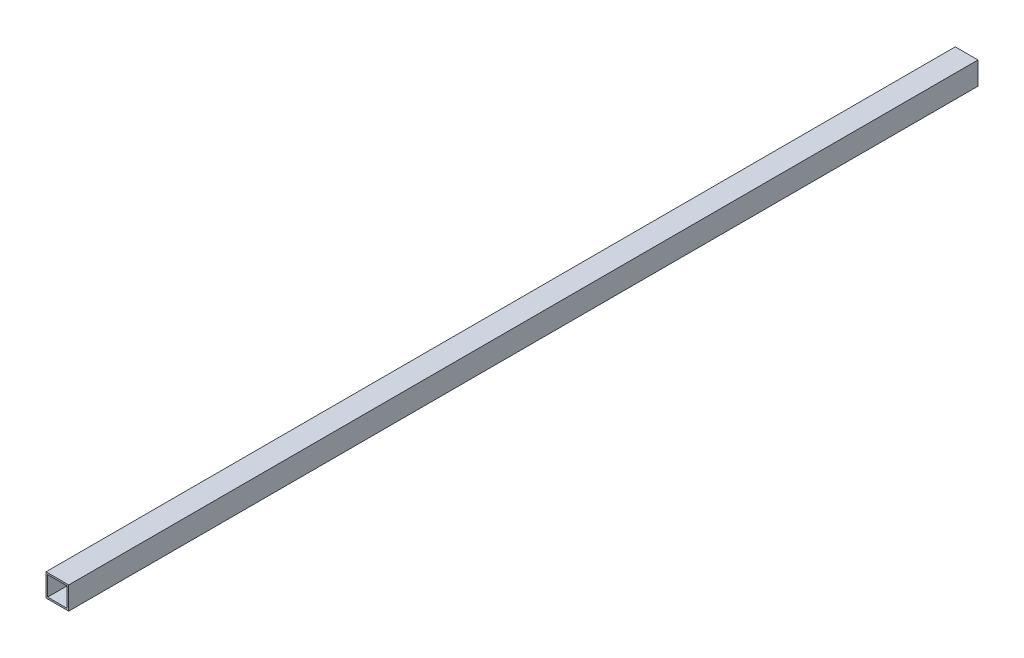
ISO-10303-21;
HEADER;
FILE_DESCRIPTION(('STEP AP214'),'2;1');
FILE_NAME('part.step','',(''),(''),'','','');
FILE_SCHEMA(('AUTOMOTIVE_DESIGN { 1 0 10303 214 1 1 1 1 }'));
ENDSEC;
DATA;
#1=APPLICATION_CONTEXT('core data for automotive mechanical design processes');
#2=APPLICATION_PROTOCOL_DEFINITION('international standard','automotive_design',2000,#1);
#3=PRODUCT_CONTEXT('',#1,'mechanical');
#4=PRODUCT('Part','Part','',(#3));
#5=PRODUCT_RELATED_PRODUCT_CATEGORY('part','',(#4));
#6=PRODUCT_DEFINITION_FORMATION('','',#4);
#7=PRODUCT_DEFINITION_CONTEXT('part definition',#1,'design');
#8=PRODUCT_DEFINITION('design','',#6,#7);
#9=PRODUCT_DEFINITION_SHAPE('','',#8);
#10=(LENGTH_UNIT() NAMED_UNIT(*) SI_UNIT(.MILLI.,.METRE.));
#11=(NAMED_UNIT(*) PLANE_ANGLE_UNIT() SI_UNIT($,.RADIAN.));
#12=(NAMED_UNIT(*) SI_UNIT($,.STERADIAN.) SOLID_ANGLE_UNIT());
#13=UNCERTAINTY_MEASURE_WITH_UNIT(LENGTH_MEASURE(1.E-05),#10,'distance_accuracy_value','');
#14=(GEOMETRIC_REPRESENTATION_CONTEXT(3) GLOBAL_UNCERTAINTY_ASSIGNED_CONTEXT((#13)) GLOBAL_UNIT_ASSIGNED_CONTEXT((#10,
#11,#12)) REPRESENTATION_CONTEXT('',''));
#15=CARTESIAN_POINT('',(0.,0.,0.));
#16=DIRECTION('',(0.,0.,1.));
#17=DIRECTION('',(1.,0.,0.));
#18=AXIS2_PLACEMENT_3D('',#15,#16,#17);
#19=CARTESIAN_POINT('',(0.,0.,1778.));
#20=DIRECTION('',(0.,0.,-1.));
#21=DIRECTION('',(-1.,0.,0.));
#22=AXIS2_PLACEMENT_3D('',#19,#20,#21);
#23=PLANE('',#22);
#24=DIRECTION('',(0.,-1.,0.));
#25=VECTOR('',#24,1.);
#26=CARTESIAN_POINT('',(0.,0.,1778.));
#27=LINE('',#26,#25);
#28=CARTESIAN_POINT('',(0.,44.45,1778.));
#29=VERTEX_POINT('',#28);
#30=CARTESIAN_POINT('',(0.,0.,1778.));
#31=VERTEX_POINT('',#30);
#32=EDGE_CURVE('E138',#29,#31,#27,.T.);
#33=ORIENTED_EDGE('',*,*,#32,.T.);
#34=DIRECTION('',(1.,0.,0.));
#35=VECTOR('',#34,1.);
#36=CARTESIAN_POINT('',(0.,0.,1778.));
#37=LINE('',#36,#35);
#38=CARTESIAN_POINT('',(44.45,0.,1778.));
#39=VERTEX_POINT('',#38);
#40=EDGE_CURVE('E141',#31,#39,#37,.T.);
#41=ORIENTED_EDGE('',*,*,#40,.T.);
#42=DIRECTION('',(0.,1.,0.));
#43=VECTOR('',#42,1.);
#44=CARTESIAN_POINT('',(44.45,0.,1778.));
#45=LINE('',#44,#43);
#46=CARTESIAN_POINT('',(44.45,44.45,1778.));
#47=VERTEX_POINT('',#46);
#48=EDGE_CURVE('E144',#39,#47,#45,.T.);
#49=ORIENTED_EDGE('',*,*,#48,.T.);
#50=DIRECTION('',(-1.,0.,0.));
#51=VECTOR('',#50,1.);
#52=CARTESIAN_POINT('',(0.,44.45,1778.));
#53=LINE('',#52,#51);
#54=EDGE_CURVE('E146',#47,#29,#53,.T.);
#55=ORIENTED_EDGE('',*,*,#54,.T.);
#56=EDGE_LOOP('',(#33,#41,#49,#55));
#57=FACE_BOUND('',#56,.T.);
#58=DIRECTION('',(0.,-1.,0.));
#59=VECTOR('',#58,1.);
#60=CARTESIAN_POINT('',(3.175,3.175,1778.));
#61=LINE('',#60,#59);
#62=CARTESIAN_POINT('',(3.175,41.275,1778.));
#63=VERTEX_POINT('',#62);
#64=CARTESIAN_POINT('',(3.175,3.175,1778.));
#65=VERTEX_POINT('',#64);
#66=EDGE_CURVE('E102',#63,#65,#61,.T.);
#67=ORIENTED_EDGE('',*,*,#66,.F.);
#68=DIRECTION('',(-1.,0.,0.));
#69=VECTOR('',#68,1.);
#70=CARTESIAN_POINT('',(3.175,41.275,1778.));
#71=LINE('',#70,#69);
#72=CARTESIAN_POINT('',(41.275,41.275,1778.));
#73=VERTEX_POINT('',#72);
#74=EDGE_CURVE('E124',#73,#63,#71,.T.);
#75=ORIENTED_EDGE('',*,*,#74,.F.);
#76=DIRECTION('',(0.,1.,0.));
#77=VECTOR('',#76,1.);
#78=CARTESIAN_POINT('',(41.275,3.175,1778.));
#79=LINE('',#78,#77);
#80=CARTESIAN_POINT('',(41.275,3.175,1778.));
#81=VERTEX_POINT('',#80);
#82=EDGE_CURVE('E122',#81,#73,#79,.T.);
#83=ORIENTED_EDGE('',*,*,#82,.F.);
#84=DIRECTION('',(1.,0.,0.));
#85=VECTOR('',#84,1.);
#86=CARTESIAN_POINT('',(3.175,3.175,1778.));
#87=LINE('',#86,#85);
#88=EDGE_CURVE('E110',#65,#81,#87,.T.);
#89=ORIENTED_EDGE('',*,*,#88,.F.);
#90=EDGE_LOOP('',(#67,#75,#83,#89));
#91=FACE_BOUND('',#90,.T.);
#92=ADVANCED_FACE('F37',(#57,#91),#23,.F.);
#93=CARTESIAN_POINT('',(0.,0.,0.));
#94=DIRECTION('',(0.,0.,-1.));
#95=DIRECTION('',(-1.,0.,0.));
#96=AXIS2_PLACEMENT_3D('',#93,#94,#95);
#97=PLANE('',#96);
#98=DIRECTION('',(0.,-1.,0.));
#99=VECTOR('',#98,1.);
#100=CARTESIAN_POINT('',(0.,0.,0.));
#101=LINE('',#100,#99);
#102=CARTESIAN_POINT('',(0.,44.45,0.));
#103=VERTEX_POINT('',#102);
#104=CARTESIAN_POINT('',(0.,0.,0.));
#105=VERTEX_POINT('',#104);
#106=EDGE_CURVE('E118',#103,#105,#101,.T.);
#107=ORIENTED_EDGE('',*,*,#106,.F.);
#108=DIRECTION('',(-1.,0.,0.));
#109=VECTOR('',#108,1.);
#110=CARTESIAN_POINT('',(0.,44.45,0.));
#111=LINE('',#110,#109);
#112=CARTESIAN_POINT('',(44.45,44.45,0.));
#113=VERTEX_POINT('',#112);
#114=EDGE_CURVE('E142',#113,#103,#111,.T.);
#115=ORIENTED_EDGE('',*,*,#114,.F.);
#116=DIRECTION('',(0.,1.,0.));
#117=VECTOR('',#116,1.);
#118=CARTESIAN_POINT('',(44.45,0.,0.));
#119=LINE('',#118,#117);
#120=CARTESIAN_POINT('',(44.45,0.,0.));
#121=VERTEX_POINT('',#120);
#122=EDGE_CURVE('E153',#121,#113,#119,.T.);
#123=ORIENTED_EDGE('',*,*,#122,.F.);
#124=DIRECTION('',(1.,0.,0.));
#125=VECTOR('',#124,1.);
#126=CARTESIAN_POINT('',(0.,0.,0.));
#127=LINE('',#126,#125);
#128=EDGE_CURVE('E151',#105,#121,#127,.T.);
#129=ORIENTED_EDGE('',*,*,#128,.F.);
#130=EDGE_LOOP('',(#107,#115,#123,#129));
#131=FACE_BOUND('',#130,.T.);
#132=DIRECTION('',(-1.,0.,0.));
#133=VECTOR('',#132,1.);
#134=CARTESIAN_POINT('',(3.175,41.275,0.));
#135=LINE('',#134,#133);
#136=CARTESIAN_POINT('',(41.275,41.275,0.));
#137=VERTEX_POINT('',#136);
#138=CARTESIAN_POINT('',(3.175,41.275,0.));
#139=VERTEX_POINT('',#138);
#140=EDGE_CURVE('E111',#137,#139,#135,.T.);
#141=ORIENTED_EDGE('',*,*,#140,.T.);
#142=DIRECTION('',(0.,-1.,0.));
#143=VECTOR('',#142,1.);
#144=CARTESIAN_POINT('',(3.175,3.175,0.));
#145=LINE('',#144,#143);
#146=CARTESIAN_POINT('',(3.175,3.175,0.));
#147=VERTEX_POINT('',#146);
#148=EDGE_CURVE('E60',#139,#147,#145,.T.);
#149=ORIENTED_EDGE('',*,*,#148,.T.);
#150=DIRECTION('',(1.,0.,0.));
#151=VECTOR('',#150,1.);
#152=CARTESIAN_POINT('',(3.175,3.175,0.));
#153=LINE('',#152,#151);
#154=CARTESIAN_POINT('',(41.275,3.175,0.));
#155=VERTEX_POINT('',#154);
#156=EDGE_CURVE('E117',#147,#155,#153,.T.);
#157=ORIENTED_EDGE('',*,*,#156,.T.);
#158=DIRECTION('',(0.,1.,0.));
#159=VECTOR('',#158,1.);
#160=CARTESIAN_POINT('',(41.275,3.175,0.));
#161=LINE('',#160,#159);
#162=EDGE_CURVE('E130',#155,#137,#161,.T.);
#163=ORIENTED_EDGE('',*,*,#162,.T.);
#164=EDGE_LOOP('',(#141,#149,#157,#163));
#165=FACE_BOUND('',#164,.T.);
#166=ADVANCED_FACE('F171',(#131,#165),#97,.T.);
#167=CARTESIAN_POINT('',(0.,0.,1778.));
#168=DIRECTION('',(1.,0.,0.));
#169=DIRECTION('',(0.,0.,-1.));
#170=AXIS2_PLACEMENT_3D('',#167,#168,#169);
#171=PLANE('',#170);
#172=ORIENTED_EDGE('',*,*,#106,.T.);
#173=DIRECTION('',(0.,0.,-1.));
#174=VECTOR('',#173,1.);
#175=CARTESIAN_POINT('',(0.,0.,1778.));
#176=LINE('',#175,#174);
#177=EDGE_CURVE('E11',#31,#105,#176,.T.);
#178=ORIENTED_EDGE('',*,*,#177,.F.);
#179=ORIENTED_EDGE('',*,*,#32,.F.);
#180=DIRECTION('',(0.,0.,-1.));
#181=VECTOR('',#180,1.);
#182=CARTESIAN_POINT('',(0.,44.45,1778.));
#183=LINE('',#182,#181);
#184=EDGE_CURVE('E148',#29,#103,#183,.T.);
#185=ORIENTED_EDGE('',*,*,#184,.T.);
#186=EDGE_LOOP('',(#172,#178,#179,#185));
#187=FACE_BOUND('',#186,.T.);
#188=ADVANCED_FACE('F39',(#187),#171,.F.);
#189=CARTESIAN_POINT('',(0.,0.,1778.));
#190=DIRECTION('',(0.,1.,0.));
#191=DIRECTION('',(0.,0.,1.));
#192=AXIS2_PLACEMENT_3D('',#189,#190,#191);
#193=PLANE('',#192);
#194=ORIENTED_EDGE('',*,*,#128,.T.);
#195=DIRECTION('',(0.,0.,-1.));
#196=VECTOR('',#195,1.);
#197=CARTESIAN_POINT('',(44.45,0.,1778.));
#198=LINE('',#197,#196);
#199=EDGE_CURVE('E45',#39,#121,#198,.T.);
#200=ORIENTED_EDGE('',*,*,#199,.F.);
#201=ORIENTED_EDGE('',*,*,#40,.F.);
#202=ORIENTED_EDGE('',*,*,#177,.T.);
#203=EDGE_LOOP('',(#194,#200,#201,#202));
#204=FACE_BOUND('',#203,.T.);
#205=ADVANCED_FACE('F181',(#204),#193,.F.);
#206=CARTESIAN_POINT('',(44.45,0.,1778.));
#207=DIRECTION('',(-1.,0.,0.));
#208=DIRECTION('',(0.,0.,1.));
#209=AXIS2_PLACEMENT_3D('',#206,#207,#208);
#210=PLANE('',#209);
#211=ORIENTED_EDGE('',*,*,#122,.T.);
#212=DIRECTION('',(0.,0.,-1.));
#213=VECTOR('',#212,1.);
#214=CARTESIAN_POINT('',(44.45,44.45,1778.));
#215=LINE('',#214,#213);
#216=EDGE_CURVE('E158',#47,#113,#215,.T.);
#217=ORIENTED_EDGE('',*,*,#216,.F.);
#218=ORIENTED_EDGE('',*,*,#48,.F.);
#219=ORIENTED_EDGE('',*,*,#199,.T.);
#220=EDGE_LOOP('',(#211,#217,#218,#219));
#221=FACE_BOUND('',#220,.T.);
#222=ADVANCED_FACE('F165',(#221),#210,.F.);
#223=CARTESIAN_POINT('',(0.,44.45,1778.));
#224=DIRECTION('',(0.,-1.,0.));
#225=DIRECTION('',(0.,0.,-1.));
#226=AXIS2_PLACEMENT_3D('',#223,#224,#225);
#227=PLANE('',#226);
#228=ORIENTED_EDGE('',*,*,#114,.T.);
#229=ORIENTED_EDGE('',*,*,#184,.F.);
#230=ORIENTED_EDGE('',*,*,#54,.F.);
#231=ORIENTED_EDGE('',*,*,#216,.T.);
#232=EDGE_LOOP('',(#228,#229,#230,#231));
#233=FACE_BOUND('',#232,.T.);
#234=ADVANCED_FACE('F175',(#233),#227,.F.);
#235=CARTESIAN_POINT('',(3.175,3.175,1778.));
#236=DIRECTION('',(1.,0.,0.));
#237=DIRECTION('',(0.,0.,-1.));
#238=AXIS2_PLACEMENT_3D('',#235,#236,#237);
#239=PLANE('',#238);
#240=ORIENTED_EDGE('',*,*,#148,.F.);
#241=DIRECTION('',(0.,0.,-1.));
#242=VECTOR('',#241,1.);
#243=CARTESIAN_POINT('',(3.175,41.275,1778.));
#244=LINE('',#243,#242);
#245=EDGE_CURVE('E106',#63,#139,#244,.T.);
#246=ORIENTED_EDGE('',*,*,#245,.F.);
#247=ORIENTED_EDGE('',*,*,#66,.T.);
#248=DIRECTION('',(0.,0.,-1.));
#249=VECTOR('',#248,1.);
#250=CARTESIAN_POINT('',(3.175,3.175,1778.));
#251=LINE('',#250,#249);
#252=EDGE_CURVE('E105',#65,#147,#251,.T.);
#253=ORIENTED_EDGE('',*,*,#252,.T.);
#254=EDGE_LOOP('',(#240,#246,#247,#253));
#255=FACE_BOUND('',#254,.T.);
#256=ADVANCED_FACE('F104',(#255),#239,.T.);
#257=CARTESIAN_POINT('',(3.175,3.175,1778.));
#258=DIRECTION('',(0.,1.,0.));
#259=DIRECTION('',(0.,0.,1.));
#260=AXIS2_PLACEMENT_3D('',#257,#258,#259);
#261=PLANE('',#260);
#262=ORIENTED_EDGE('',*,*,#156,.F.);
#263=ORIENTED_EDGE('',*,*,#252,.F.);
#264=ORIENTED_EDGE('',*,*,#88,.T.);
#265=DIRECTION('',(0.,0.,-1.));
#266=VECTOR('',#265,1.);
#267=CARTESIAN_POINT('',(41.275,3.175,1778.));
#268=LINE('',#267,#266);
#269=EDGE_CURVE('E119',#81,#155,#268,.T.);
#270=ORIENTED_EDGE('',*,*,#269,.T.);
#271=EDGE_LOOP('',(#262,#263,#264,#270));
#272=FACE_BOUND('',#271,.T.);
#273=ADVANCED_FACE('F114',(#272),#261,.T.);
#274=CARTESIAN_POINT('',(41.275,3.175,1778.));
#275=DIRECTION('',(-1.,0.,0.));
#276=DIRECTION('',(0.,0.,1.));
#277=AXIS2_PLACEMENT_3D('',#274,#275,#276);
#278=PLANE('',#277);
#279=ORIENTED_EDGE('',*,*,#162,.F.);
#280=ORIENTED_EDGE('',*,*,#269,.F.);
#281=ORIENTED_EDGE('',*,*,#82,.T.);
#282=DIRECTION('',(0.,0.,-1.));
#283=VECTOR('',#282,1.);
#284=CARTESIAN_POINT('',(41.275,41.275,1778.));
#285=LINE('',#284,#283);
#286=EDGE_CURVE('E52',#73,#137,#285,.T.);
#287=ORIENTED_EDGE('',*,*,#286,.T.);
#288=EDGE_LOOP('',(#279,#280,#281,#287));
#289=FACE_BOUND('',#288,.T.);
#290=ADVANCED_FACE('F204',(#289),#278,.T.);
#291=CARTESIAN_POINT('',(3.175,41.275,1778.));
#292=DIRECTION('',(0.,-1.,0.));
#293=DIRECTION('',(0.,0.,-1.));
#294=AXIS2_PLACEMENT_3D('',#291,#292,#293);
#295=PLANE('',#294);
#296=ORIENTED_EDGE('',*,*,#140,.F.);
#297=ORIENTED_EDGE('',*,*,#286,.F.);
#298=ORIENTED_EDGE('',*,*,#74,.T.);
#299=ORIENTED_EDGE('',*,*,#245,.T.);
#300=EDGE_LOOP('',(#296,#297,#298,#299));
#301=FACE_BOUND('',#300,.T.);
#302=ADVANCED_FACE('F208',(#301),#295,.T.);
#303=CLOSED_SHELL('',(#92,#166,#188,#205,#222,#234,#256,#273,#290,#302));
#304=MANIFOLD_SOLID_BREP('B2',#303);
#305=ADVANCED_BREP_SHAPE_REPRESENTATION('',(#18,#304),#14);
#306=SHAPE_DEFINITION_REPRESENTATION(#9,#305);
ENDSEC;
END-ISO-10303-21;
